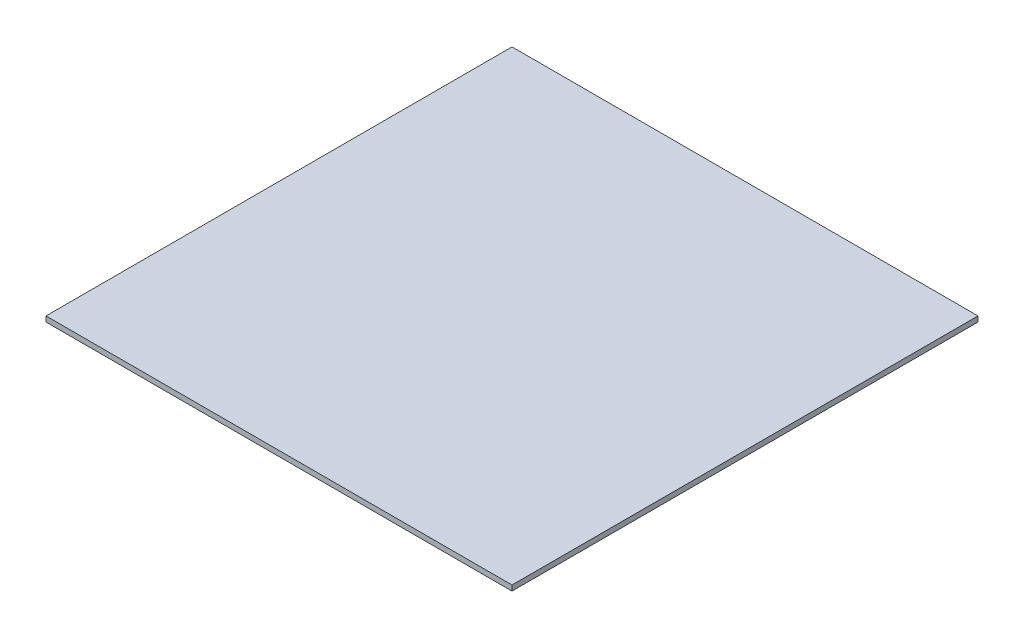
ISO-10303-21;
HEADER;
FILE_DESCRIPTION(('STEP AP214'),'2;1');
FILE_NAME('part.step','',(''),(''),'','','');
FILE_SCHEMA(('AUTOMOTIVE_DESIGN { 1 0 10303 214 1 1 1 1 }'));
ENDSEC;
DATA;
#1=APPLICATION_CONTEXT('core data for automotive mechanical design processes');
#2=APPLICATION_PROTOCOL_DEFINITION('international standard','automotive_design',2000,#1);
#3=PRODUCT_CONTEXT('',#1,'mechanical');
#4=PRODUCT('Part','Part','',(#3));
#5=PRODUCT_RELATED_PRODUCT_CATEGORY('part','',(#4));
#6=PRODUCT_DEFINITION_FORMATION('','',#4);
#7=PRODUCT_DEFINITION_CONTEXT('part definition',#1,'design');
#8=PRODUCT_DEFINITION('design','',#6,#7);
#9=PRODUCT_DEFINITION_SHAPE('','',#8);
#10=(LENGTH_UNIT() NAMED_UNIT(*) SI_UNIT(.MILLI.,.METRE.));
#11=(NAMED_UNIT(*) PLANE_ANGLE_UNIT() SI_UNIT($,.RADIAN.));
#12=(NAMED_UNIT(*) SI_UNIT($,.STERADIAN.) SOLID_ANGLE_UNIT());
#13=UNCERTAINTY_MEASURE_WITH_UNIT(LENGTH_MEASURE(1.E-05),#10,'distance_accuracy_value','');
#14=(GEOMETRIC_REPRESENTATION_CONTEXT(3) GLOBAL_UNCERTAINTY_ASSIGNED_CONTEXT((#13)) GLOBAL_UNIT_ASSIGNED_CONTEXT((#10,
#11,#12)) REPRESENTATION_CONTEXT('',''));
#15=CARTESIAN_POINT('',(0.,0.,0.));
#16=DIRECTION('',(0.,0.,1.));
#17=DIRECTION('',(1.,0.,0.));
#18=AXIS2_PLACEMENT_3D('',#15,#16,#17);
#19=CARTESIAN_POINT('',(765.567681502675,945.425510445155,1280.34608228285));
#20=DIRECTION('',(1.,0.,0.));
#21=DIRECTION('',(0.,0.,-1.));
#22=AXIS2_PLACEMENT_3D('',#19,#20,#21);
#23=PLANE('',#22);
#24=DIRECTION('',(0.,0.,1.));
#25=VECTOR('',#24,1.);
#26=CARTESIAN_POINT('',(765.567681502675,944.132636218316,1280.34608228285));
#27=LINE('',#26,#25);
#28=CARTESIAN_POINT('',(765.567681502675,944.132636218316,1280.34608228285));
#29=VERTEX_POINT('',#28);
#30=CARTESIAN_POINT('',(765.567681502675,944.132636218316,1393.45735212007));
#31=VERTEX_POINT('',#30);
#32=EDGE_CURVE('E79',#29,#31,#27,.T.);
#33=ORIENTED_EDGE('',*,*,#32,.F.);
#34=DIRECTION('',(0.,-1.,0.));
#35=VECTOR('',#34,1.);
#36=CARTESIAN_POINT('',(765.567681502675,945.425510445155,1280.34608228285));
#37=LINE('',#36,#35);
#38=CARTESIAN_POINT('',(765.567681502675,945.425510445155,1280.34608228285));
#39=VERTEX_POINT('',#38);
#40=EDGE_CURVE('E32',#39,#29,#37,.T.);
#41=ORIENTED_EDGE('',*,*,#40,.F.);
#42=DIRECTION('',(0.,0.,1.));
#43=VECTOR('',#42,1.);
#44=CARTESIAN_POINT('',(765.567681502675,945.425510445155,1280.34608228285));
#45=LINE('',#44,#43);
#46=CARTESIAN_POINT('',(765.567681502675,945.425510445155,1393.45735212007));
#47=VERTEX_POINT('',#46);
#48=EDGE_CURVE('E71',#39,#47,#45,.T.);
#49=ORIENTED_EDGE('',*,*,#48,.T.);
#50=DIRECTION('',(0.,-1.,0.));
#51=VECTOR('',#50,1.);
#52=CARTESIAN_POINT('',(765.567681502675,945.425510445155,1393.45735212007));
#53=LINE('',#52,#51);
#54=EDGE_CURVE('E10',#47,#31,#53,.T.);
#55=ORIENTED_EDGE('',*,*,#54,.T.);
#56=EDGE_LOOP('',(#33,#41,#49,#55));
#57=FACE_BOUND('',#56,.T.);
#58=ADVANCED_FACE('F16',(#57),#23,.T.);
#59=CARTESIAN_POINT('',(765.567681502675,945.425510445155,1393.45735212007));
#60=DIRECTION('',(0.,0.,1.));
#61=DIRECTION('',(1.,0.,0.));
#62=AXIS2_PLACEMENT_3D('',#59,#60,#61);
#63=PLANE('',#62);
#64=DIRECTION('',(-1.,0.,0.));
#65=VECTOR('',#64,1.);
#66=CARTESIAN_POINT('',(765.567681502675,944.132636218316,1393.45735212007));
#67=LINE('',#66,#65);
#68=CARTESIAN_POINT('',(652.456411665454,944.132636218316,1393.45735212007));
#69=VERTEX_POINT('',#68);
#70=EDGE_CURVE('E82',#31,#69,#67,.T.);
#71=ORIENTED_EDGE('',*,*,#70,.F.);
#72=ORIENTED_EDGE('',*,*,#54,.F.);
#73=DIRECTION('',(-1.,0.,0.));
#74=VECTOR('',#73,1.);
#75=CARTESIAN_POINT('',(765.567681502675,945.425510445155,1393.45735212007));
#76=LINE('',#75,#74);
#77=CARTESIAN_POINT('',(652.456411665454,945.425510445155,1393.45735212007));
#78=VERTEX_POINT('',#77);
#79=EDGE_CURVE('E67',#47,#78,#76,.T.);
#80=ORIENTED_EDGE('',*,*,#79,.T.);
#81=DIRECTION('',(0.,-1.,0.));
#82=VECTOR('',#81,1.);
#83=CARTESIAN_POINT('',(652.456411665454,945.425510445155,1393.45735212007));
#84=LINE('',#83,#82);
#85=EDGE_CURVE('E24',#78,#69,#84,.T.);
#86=ORIENTED_EDGE('',*,*,#85,.T.);
#87=EDGE_LOOP('',(#71,#72,#80,#86));
#88=FACE_BOUND('',#87,.T.);
#89=ADVANCED_FACE('F68',(#88),#63,.T.);
#90=CARTESIAN_POINT('',(652.456411665454,945.425510445155,1393.45735212007));
#91=DIRECTION('',(-1.,0.,0.));
#92=DIRECTION('',(0.,0.,1.));
#93=AXIS2_PLACEMENT_3D('',#90,#91,#92);
#94=PLANE('',#93);
#95=DIRECTION('',(0.,0.,-1.));
#96=VECTOR('',#95,1.);
#97=CARTESIAN_POINT('',(652.456411665454,944.132636218316,1393.45735212007));
#98=LINE('',#97,#96);
#99=CARTESIAN_POINT('',(652.456411665454,944.132636218316,1280.34608228285));
#100=VERTEX_POINT('',#99);
#101=EDGE_CURVE('E65',#69,#100,#98,.T.);
#102=ORIENTED_EDGE('',*,*,#101,.F.);
#103=ORIENTED_EDGE('',*,*,#85,.F.);
#104=DIRECTION('',(0.,0.,-1.));
#105=VECTOR('',#104,1.);
#106=CARTESIAN_POINT('',(652.456411665454,945.425510445155,1393.45735212007));
#107=LINE('',#106,#105);
#108=CARTESIAN_POINT('',(652.456411665454,945.425510445155,1280.34608228285));
#109=VERTEX_POINT('',#108);
#110=EDGE_CURVE('E62',#78,#109,#107,.T.);
#111=ORIENTED_EDGE('',*,*,#110,.T.);
#112=DIRECTION('',(0.,-1.,0.));
#113=VECTOR('',#112,1.);
#114=CARTESIAN_POINT('',(652.456411665454,945.425510445155,1280.34608228285));
#115=LINE('',#114,#113);
#116=EDGE_CURVE('E48',#109,#100,#115,.T.);
#117=ORIENTED_EDGE('',*,*,#116,.T.);
#118=EDGE_LOOP('',(#102,#103,#111,#117));
#119=FACE_BOUND('',#118,.T.);
#120=ADVANCED_FACE('F60',(#119),#94,.T.);
#121=CARTESIAN_POINT('',(652.456411665454,945.425510445155,1280.34608228285));
#122=DIRECTION('',(0.,0.,-1.));
#123=DIRECTION('',(-1.,0.,0.));
#124=AXIS2_PLACEMENT_3D('',#121,#122,#123);
#125=PLANE('',#124);
#126=DIRECTION('',(1.,0.,0.));
#127=VECTOR('',#126,1.);
#128=CARTESIAN_POINT('',(652.456411665454,944.132636218316,1280.34608228285));
#129=LINE('',#128,#127);
#130=EDGE_CURVE('E85',#100,#29,#129,.T.);
#131=ORIENTED_EDGE('',*,*,#130,.F.);
#132=ORIENTED_EDGE('',*,*,#116,.F.);
#133=DIRECTION('',(1.,0.,0.));
#134=VECTOR('',#133,1.);
#135=CARTESIAN_POINT('',(652.456411665454,945.425510445155,1280.34608228285));
#136=LINE('',#135,#134);
#137=EDGE_CURVE('E74',#109,#39,#136,.T.);
#138=ORIENTED_EDGE('',*,*,#137,.T.);
#139=ORIENTED_EDGE('',*,*,#40,.T.);
#140=EDGE_LOOP('',(#131,#132,#138,#139));
#141=FACE_BOUND('',#140,.T.);
#142=ADVANCED_FACE('F96',(#141),#125,.T.);
#143=CARTESIAN_POINT('',(709.012046584064,945.425510445155,1380.90171720146));
#144=DIRECTION('',(0.,-1.,0.));
#145=DIRECTION('',(1.,0.,0.));
#146=AXIS2_PLACEMENT_3D('',#143,#144,#145);
#147=PLANE('',#146);
#148=ORIENTED_EDGE('',*,*,#48,.F.);
#149=ORIENTED_EDGE('',*,*,#137,.F.);
#150=ORIENTED_EDGE('',*,*,#110,.F.);
#151=ORIENTED_EDGE('',*,*,#79,.F.);
#152=EDGE_LOOP('',(#148,#149,#150,#151));
#153=FACE_BOUND('',#152,.T.);
#154=ADVANCED_FACE('F73',(#153),#147,.F.);
#155=CARTESIAN_POINT('',(709.012046584064,944.132636218316,1380.90171720146));
#156=DIRECTION('',(0.,-1.,0.));
#157=DIRECTION('',(1.,0.,0.));
#158=AXIS2_PLACEMENT_3D('',#155,#156,#157);
#159=PLANE('',#158);
#160=ORIENTED_EDGE('',*,*,#32,.T.);
#161=ORIENTED_EDGE('',*,*,#70,.T.);
#162=ORIENTED_EDGE('',*,*,#101,.T.);
#163=ORIENTED_EDGE('',*,*,#130,.T.);
#164=EDGE_LOOP('',(#160,#161,#162,#163));
#165=FACE_BOUND('',#164,.T.);
#166=ADVANCED_FACE('F89',(#165),#159,.T.);
#167=CLOSED_SHELL('',(#58,#89,#120,#142,#154,#166));
#168=MANIFOLD_SOLID_BREP('B1',#167);
#169=ADVANCED_BREP_SHAPE_REPRESENTATION('',(#18,#168),#14);
#170=SHAPE_DEFINITION_REPRESENTATION(#9,#169);
ENDSEC;
END-ISO-10303-21;
